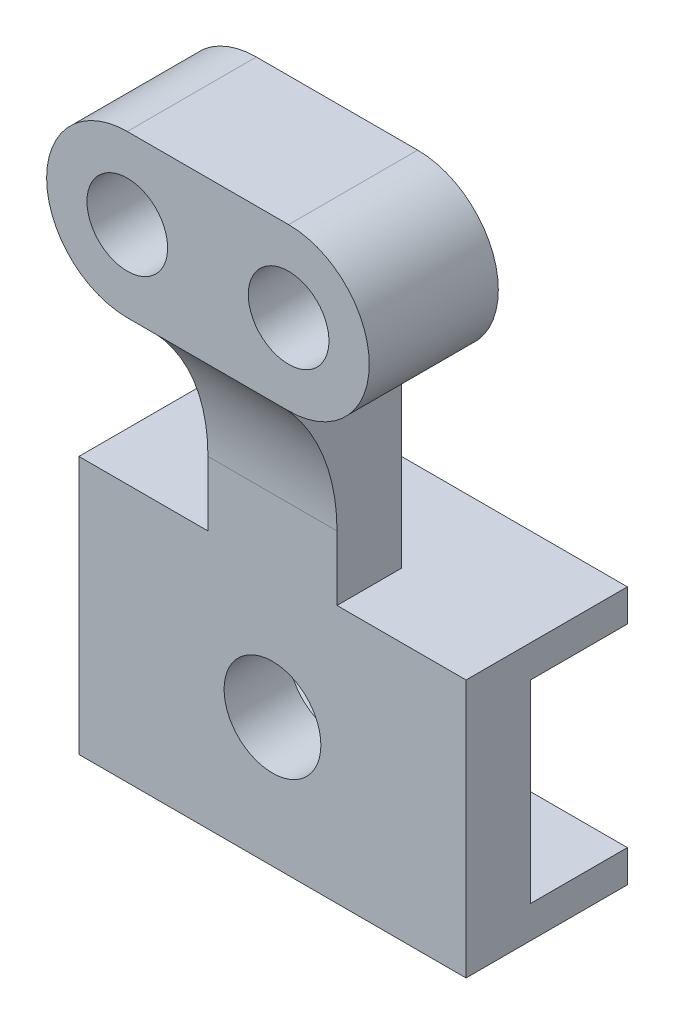
ISO-10303-21;
HEADER;
FILE_DESCRIPTION(('STEP AP214'),'2;1');
FILE_NAME('part.step','',(''),(''),'','','');
FILE_SCHEMA(('AUTOMOTIVE_DESIGN { 1 0 10303 214 1 1 1 1 }'));
ENDSEC;
DATA;
#1=APPLICATION_CONTEXT('core data for automotive mechanical design processes');
#2=APPLICATION_PROTOCOL_DEFINITION('international standard','automotive_design',2000,#1);
#3=PRODUCT_CONTEXT('',#1,'mechanical');
#4=PRODUCT('Part','Part','',(#3));
#5=PRODUCT_RELATED_PRODUCT_CATEGORY('part','',(#4));
#6=PRODUCT_DEFINITION_FORMATION('','',#4);
#7=PRODUCT_DEFINITION_CONTEXT('part definition',#1,'design');
#8=PRODUCT_DEFINITION('design','',#6,#7);
#9=PRODUCT_DEFINITION_SHAPE('','',#8);
#10=(LENGTH_UNIT() NAMED_UNIT(*) SI_UNIT(.MILLI.,.METRE.));
#11=(NAMED_UNIT(*) PLANE_ANGLE_UNIT() SI_UNIT($,.RADIAN.));
#12=(NAMED_UNIT(*) SI_UNIT($,.STERADIAN.) SOLID_ANGLE_UNIT());
#13=UNCERTAINTY_MEASURE_WITH_UNIT(LENGTH_MEASURE(1.E-05),#10,'distance_accuracy_value','');
#14=(GEOMETRIC_REPRESENTATION_CONTEXT(3) GLOBAL_UNCERTAINTY_ASSIGNED_CONTEXT((#13)) GLOBAL_UNIT_ASSIGNED_CONTEXT((#10,
#11,#12)) REPRESENTATION_CONTEXT('',''));
#15=CARTESIAN_POINT('',(0.,0.,0.));
#16=DIRECTION('',(0.,0.,1.));
#17=DIRECTION('',(1.,0.,0.));
#18=AXIS2_PLACEMENT_3D('',#15,#16,#17);
#19=CARTESIAN_POINT('',(38.1,-6.35,0.));
#20=DIRECTION('',(0.,0.,1.));
#21=DIRECTION('',(1.,0.,0.));
#22=AXIS2_PLACEMENT_3D('',#19,#20,#21);
#23=PLANE('',#22);
#24=DIRECTION('',(0.,1.,0.));
#25=VECTOR('',#24,1.);
#26=CARTESIAN_POINT('',(-38.1,-6.35,0.));
#27=LINE('',#26,#25);
#28=CARTESIAN_POINT('',(-38.1,-6.35,0.));
#29=VERTEX_POINT('',#28);
#30=CARTESIAN_POINT('',(-38.1,0.,0.));
#31=VERTEX_POINT('',#30);
#32=EDGE_CURVE('E244',#29,#31,#27,.T.);
#33=ORIENTED_EDGE('',*,*,#32,.T.);
#34=DIRECTION('',(-1.,0.,0.));
#35=VECTOR('',#34,1.);
#36=CARTESIAN_POINT('',(38.1,0.,0.));
#37=LINE('',#36,#35);
#38=CARTESIAN_POINT('',(38.1,0.,0.));
#39=VERTEX_POINT('',#38);
#40=EDGE_CURVE('E11',#39,#31,#37,.T.);
#41=ORIENTED_EDGE('',*,*,#40,.F.);
#42=DIRECTION('',(0.,1.,0.));
#43=VECTOR('',#42,1.);
#44=CARTESIAN_POINT('',(38.1,-6.35,0.));
#45=LINE('',#44,#43);
#46=CARTESIAN_POINT('',(38.1,-6.35,0.));
#47=VERTEX_POINT('',#46);
#48=EDGE_CURVE('E245',#47,#39,#45,.T.);
#49=ORIENTED_EDGE('',*,*,#48,.F.);
#50=DIRECTION('',(-1.,0.,0.));
#51=VECTOR('',#50,1.);
#52=CARTESIAN_POINT('',(38.1,-6.35,0.));
#53=LINE('',#52,#51);
#54=EDGE_CURVE('E263',#47,#29,#53,.T.);
#55=ORIENTED_EDGE('',*,*,#54,.T.);
#56=EDGE_LOOP('',(#33,#41,#49,#55));
#57=FACE_BOUND('',#56,.T.);
#58=ADVANCED_FACE('F41',(#57),#23,.F.);
#59=CARTESIAN_POINT('',(38.1,0.,0.));
#60=DIRECTION('',(0.,-1.,0.));
#61=DIRECTION('',(0.,0.,-1.));
#62=AXIS2_PLACEMENT_3D('',#59,#60,#61);
#63=PLANE('',#62);
#64=DIRECTION('',(-1.,0.,0.));
#65=VECTOR('',#64,1.);
#66=CARTESIAN_POINT('',(38.1,0.,31.75));
#67=LINE('',#66,#65);
#68=CARTESIAN_POINT('',(-12.7,0.,31.75));
#69=VERTEX_POINT('',#68);
#70=CARTESIAN_POINT('',(-38.1,0.,31.75));
#71=VERTEX_POINT('',#70);
#72=EDGE_CURVE('E61',#69,#71,#67,.T.);
#73=ORIENTED_EDGE('',*,*,#72,.F.);
#74=DIRECTION('',(0.,0.,-1.));
#75=VECTOR('',#74,1.);
#76=CARTESIAN_POINT('',(-12.7,0.,31.75));
#77=LINE('',#76,#75);
#78=CARTESIAN_POINT('',(-12.7,0.,19.05));
#79=VERTEX_POINT('',#78);
#80=EDGE_CURVE('E56',#69,#79,#77,.T.);
#81=ORIENTED_EDGE('',*,*,#80,.T.);
#82=DIRECTION('',(-1.,0.,0.));
#83=VECTOR('',#82,1.);
#84=CARTESIAN_POINT('',(12.7,0.,19.05));
#85=LINE('',#84,#83);
#86=CARTESIAN_POINT('',(12.7,0.,19.05));
#87=VERTEX_POINT('',#86);
#88=EDGE_CURVE('E238',#87,#79,#85,.T.);
#89=ORIENTED_EDGE('',*,*,#88,.F.);
#90=DIRECTION('',(0.,0.,-1.));
#91=VECTOR('',#90,1.);
#92=CARTESIAN_POINT('',(12.7,0.,31.75));
#93=LINE('',#92,#91);
#94=CARTESIAN_POINT('',(12.7,0.,31.75));
#95=VERTEX_POINT('',#94);
#96=EDGE_CURVE('E210',#95,#87,#93,.T.);
#97=ORIENTED_EDGE('',*,*,#96,.F.);
#98=CARTESIAN_POINT('',(38.1,0.,31.75));
#99=VERTEX_POINT('',#98);
#100=EDGE_CURVE('E49',#99,#95,#67,.T.);
#101=ORIENTED_EDGE('',*,*,#100,.F.);
#102=DIRECTION('',(0.,0.,1.));
#103=VECTOR('',#102,1.);
#104=CARTESIAN_POINT('',(38.1,0.,0.));
#105=LINE('',#104,#103);
#106=EDGE_CURVE('E248',#39,#99,#105,.T.);
#107=ORIENTED_EDGE('',*,*,#106,.F.);
#108=ORIENTED_EDGE('',*,*,#40,.T.);
#109=DIRECTION('',(0.,0.,1.));
#110=VECTOR('',#109,1.);
#111=CARTESIAN_POINT('',(-38.1,0.,0.));
#112=LINE('',#111,#110);
#113=EDGE_CURVE('E266',#31,#71,#112,.T.);
#114=ORIENTED_EDGE('',*,*,#113,.T.);
#115=EDGE_LOOP('',(#73,#81,#89,#97,#101,#107,#108,#114));
#116=FACE_BOUND('',#115,.T.);
#117=ADVANCED_FACE('F305',(#116),#63,.F.);
#118=CARTESIAN_POINT('',(38.1,0.,31.75));
#119=DIRECTION('',(0.,0.,-1.));
#120=DIRECTION('',(0.,1.,0.));
#121=AXIS2_PLACEMENT_3D('',#118,#119,#120);
#122=PLANE('',#121);
#123=CARTESIAN_POINT('',(0.,-25.4,31.75));
#124=DIRECTION('',(0.,0.,-1.));
#125=DIRECTION('',(0.,1.,0.));
#126=AXIS2_PLACEMENT_3D('',#123,#124,#125);
#127=CIRCLE('',#126,9.525);
#128=CARTESIAN_POINT('',(0.,-15.875,31.75));
#129=VERTEX_POINT('',#128);
#130=EDGE_CURVE('E241',#129,#129,#127,.T.);
#131=ORIENTED_EDGE('',*,*,#130,.T.);
#132=EDGE_LOOP('',(#131));
#133=FACE_BOUND('',#132,.T.);
#134=DIRECTION('',(0.,-1.,0.));
#135=VECTOR('',#134,1.);
#136=CARTESIAN_POINT('',(-38.1,0.,31.75));
#137=LINE('',#136,#135);
#138=CARTESIAN_POINT('',(-38.1,-50.8,31.75));
#139=VERTEX_POINT('',#138);
#140=EDGE_CURVE('E268',#71,#139,#137,.T.);
#141=ORIENTED_EDGE('',*,*,#140,.T.);
#142=DIRECTION('',(-1.,0.,0.));
#143=VECTOR('',#142,1.);
#144=CARTESIAN_POINT('',(38.1,-50.8,31.75));
#145=LINE('',#144,#143);
#146=CARTESIAN_POINT('',(38.1,-50.8,31.75));
#147=VERTEX_POINT('',#146);
#148=EDGE_CURVE('E293',#147,#139,#145,.T.);
#149=ORIENTED_EDGE('',*,*,#148,.F.);
#150=DIRECTION('',(0.,-1.,0.));
#151=VECTOR('',#150,1.);
#152=CARTESIAN_POINT('',(38.1,0.,31.75));
#153=LINE('',#152,#151);
#154=EDGE_CURVE('E251',#99,#147,#153,.T.);
#155=ORIENTED_EDGE('',*,*,#154,.F.);
#156=ORIENTED_EDGE('',*,*,#100,.T.);
#157=DIRECTION('',(0.,-1.,0.));
#158=VECTOR('',#157,1.);
#159=CARTESIAN_POINT('',(12.7,12.7,31.75));
#160=LINE('',#159,#158);
#161=CARTESIAN_POINT('',(12.7,12.7,31.75));
#162=VERTEX_POINT('',#161);
#163=EDGE_CURVE('E220',#162,#95,#160,.T.);
#164=ORIENTED_EDGE('',*,*,#163,.F.);
#165=DIRECTION('',(-1.,0.,0.));
#166=VECTOR('',#165,1.);
#167=CARTESIAN_POINT('',(12.7,12.7,31.75));
#168=LINE('',#167,#166);
#169=CARTESIAN_POINT('',(-12.7,12.7,31.75));
#170=VERTEX_POINT('',#169);
#171=EDGE_CURVE('E223',#162,#170,#168,.T.);
#172=ORIENTED_EDGE('',*,*,#171,.T.);
#173=DIRECTION('',(0.,-1.,0.));
#174=VECTOR('',#173,1.);
#175=CARTESIAN_POINT('',(-12.7,12.7,31.75));
#176=LINE('',#175,#174);
#177=EDGE_CURVE('E214',#170,#69,#176,.T.);
#178=ORIENTED_EDGE('',*,*,#177,.T.);
#179=ORIENTED_EDGE('',*,*,#72,.T.);
#180=EDGE_LOOP('',(#141,#149,#155,#156,#164,#172,#178,#179));
#181=FACE_BOUND('',#180,.T.);
#182=ADVANCED_FACE('F301',(#133,#181),#122,.F.);
#183=CARTESIAN_POINT('',(38.1,-50.8,31.75));
#184=DIRECTION('',(0.,1.,0.));
#185=DIRECTION('',(0.,0.,1.));
#186=AXIS2_PLACEMENT_3D('',#183,#184,#185);
#187=PLANE('',#186);
#188=DIRECTION('',(0.,0.,-1.));
#189=VECTOR('',#188,1.);
#190=CARTESIAN_POINT('',(-38.1,-50.8,31.75));
#191=LINE('',#190,#189);
#192=CARTESIAN_POINT('',(-38.1,-50.8,0.));
#193=VERTEX_POINT('',#192);
#194=EDGE_CURVE('E270',#139,#193,#191,.T.);
#195=ORIENTED_EDGE('',*,*,#194,.T.);
#196=DIRECTION('',(-1.,0.,0.));
#197=VECTOR('',#196,1.);
#198=CARTESIAN_POINT('',(38.1,-50.8,0.));
#199=LINE('',#198,#197);
#200=CARTESIAN_POINT('',(38.1,-50.8,0.));
#201=VERTEX_POINT('',#200);
#202=EDGE_CURVE('E290',#201,#193,#199,.T.);
#203=ORIENTED_EDGE('',*,*,#202,.F.);
#204=DIRECTION('',(0.,0.,-1.));
#205=VECTOR('',#204,1.);
#206=CARTESIAN_POINT('',(38.1,-50.8,31.75));
#207=LINE('',#206,#205);
#208=EDGE_CURVE('E253',#147,#201,#207,.T.);
#209=ORIENTED_EDGE('',*,*,#208,.F.);
#210=ORIENTED_EDGE('',*,*,#148,.T.);
#211=EDGE_LOOP('',(#195,#203,#209,#210));
#212=FACE_BOUND('',#211,.T.);
#213=ADVANCED_FACE('F315',(#212),#187,.F.);
#214=CARTESIAN_POINT('',(38.1,-50.8,0.));
#215=DIRECTION('',(0.,0.,1.));
#216=DIRECTION('',(0.,-1.,0.));
#217=AXIS2_PLACEMENT_3D('',#214,#215,#216);
#218=PLANE('',#217);
#219=DIRECTION('',(0.,1.,0.));
#220=VECTOR('',#219,1.);
#221=CARTESIAN_POINT('',(-38.1,-50.8,0.));
#222=LINE('',#221,#220);
#223=CARTESIAN_POINT('',(-38.1,-44.45,0.));
#224=VERTEX_POINT('',#223);
#225=EDGE_CURVE('E272',#193,#224,#222,.T.);
#226=ORIENTED_EDGE('',*,*,#225,.T.);
#227=DIRECTION('',(-1.,0.,0.));
#228=VECTOR('',#227,1.);
#229=CARTESIAN_POINT('',(38.1,-44.45,0.));
#230=LINE('',#229,#228);
#231=CARTESIAN_POINT('',(38.1,-44.45,0.));
#232=VERTEX_POINT('',#231);
#233=EDGE_CURVE('E287',#232,#224,#230,.T.);
#234=ORIENTED_EDGE('',*,*,#233,.F.);
#235=DIRECTION('',(0.,1.,0.));
#236=VECTOR('',#235,1.);
#237=CARTESIAN_POINT('',(38.1,-50.8,0.));
#238=LINE('',#237,#236);
#239=EDGE_CURVE('E255',#201,#232,#238,.T.);
#240=ORIENTED_EDGE('',*,*,#239,.F.);
#241=ORIENTED_EDGE('',*,*,#202,.T.);
#242=EDGE_LOOP('',(#226,#234,#240,#241));
#243=FACE_BOUND('',#242,.T.);
#244=ADVANCED_FACE('F319',(#243),#218,.F.);
#245=CARTESIAN_POINT('',(38.1,-44.45,0.));
#246=DIRECTION('',(0.,-1.,0.));
#247=DIRECTION('',(0.,0.,-1.));
#248=AXIS2_PLACEMENT_3D('',#245,#246,#247);
#249=PLANE('',#248);
#250=DIRECTION('',(0.,0.,1.));
#251=VECTOR('',#250,1.);
#252=CARTESIAN_POINT('',(-38.1,-44.45,0.));
#253=LINE('',#252,#251);
#254=CARTESIAN_POINT('',(-38.1,-44.45,19.05));
#255=VERTEX_POINT('',#254);
#256=EDGE_CURVE('E274',#224,#255,#253,.T.);
#257=ORIENTED_EDGE('',*,*,#256,.T.);
#258=DIRECTION('',(-1.,0.,0.));
#259=VECTOR('',#258,1.);
#260=CARTESIAN_POINT('',(38.1,-44.45,19.05));
#261=LINE('',#260,#259);
#262=CARTESIAN_POINT('',(38.1,-44.45,19.05));
#263=VERTEX_POINT('',#262);
#264=EDGE_CURVE('E284',#263,#255,#261,.T.);
#265=ORIENTED_EDGE('',*,*,#264,.F.);
#266=DIRECTION('',(0.,0.,1.));
#267=VECTOR('',#266,1.);
#268=CARTESIAN_POINT('',(38.1,-44.45,0.));
#269=LINE('',#268,#267);
#270=EDGE_CURVE('E257',#232,#263,#269,.T.);
#271=ORIENTED_EDGE('',*,*,#270,.F.);
#272=ORIENTED_EDGE('',*,*,#233,.T.);
#273=EDGE_LOOP('',(#257,#265,#271,#272));
#274=FACE_BOUND('',#273,.T.);
#275=ADVANCED_FACE('F377',(#274),#249,.F.);
#276=CARTESIAN_POINT('',(38.1,-44.45,19.05));
#277=DIRECTION('',(0.,0.,1.));
#278=DIRECTION('',(0.,-1.,0.));
#279=AXIS2_PLACEMENT_3D('',#276,#277,#278);
#280=PLANE('',#279);
#281=CARTESIAN_POINT('',(0.,-25.4,19.05));
#282=DIRECTION('',(0.,0.,1.));
#283=DIRECTION('',(0.,-1.,0.));
#284=AXIS2_PLACEMENT_3D('',#281,#282,#283);
#285=CIRCLE('',#284,9.525);
#286=CARTESIAN_POINT('',(0.,-34.925,19.05));
#287=VERTEX_POINT('',#286);
#288=EDGE_CURVE('E44',#287,#287,#285,.T.);
#289=ORIENTED_EDGE('',*,*,#288,.T.);
#290=EDGE_LOOP('',(#289));
#291=FACE_BOUND('',#290,.T.);
#292=DIRECTION('',(0.,1.,0.));
#293=VECTOR('',#292,1.);
#294=CARTESIAN_POINT('',(-38.1,-44.45,19.05));
#295=LINE('',#294,#293);
#296=CARTESIAN_POINT('',(-38.1,-6.35,19.05));
#297=VERTEX_POINT('',#296);
#298=EDGE_CURVE('E276',#255,#297,#295,.T.);
#299=ORIENTED_EDGE('',*,*,#298,.T.);
#300=DIRECTION('',(-1.,0.,0.));
#301=VECTOR('',#300,1.);
#302=CARTESIAN_POINT('',(38.1,-6.35,19.05));
#303=LINE('',#302,#301);
#304=CARTESIAN_POINT('',(38.1,-6.35,19.05));
#305=VERTEX_POINT('',#304);
#306=EDGE_CURVE('E281',#305,#297,#303,.T.);
#307=ORIENTED_EDGE('',*,*,#306,.F.);
#308=DIRECTION('',(0.,1.,0.));
#309=VECTOR('',#308,1.);
#310=CARTESIAN_POINT('',(38.1,-44.45,19.05));
#311=LINE('',#310,#309);
#312=EDGE_CURVE('E259',#263,#305,#311,.T.);
#313=ORIENTED_EDGE('',*,*,#312,.F.);
#314=ORIENTED_EDGE('',*,*,#264,.T.);
#315=EDGE_LOOP('',(#299,#307,#313,#314));
#316=FACE_BOUND('',#315,.T.);
#317=ADVANCED_FACE('F375',(#291,#316),#280,.F.);
#318=CARTESIAN_POINT('',(38.1,-6.35,19.05));
#319=DIRECTION('',(0.,1.,0.));
#320=DIRECTION('',(0.,0.,1.));
#321=AXIS2_PLACEMENT_3D('',#318,#319,#320);
#322=PLANE('',#321);
#323=DIRECTION('',(0.,0.,-1.));
#324=VECTOR('',#323,1.);
#325=CARTESIAN_POINT('',(-38.1,-6.35,19.05));
#326=LINE('',#325,#324);
#327=EDGE_CURVE('E249',#297,#29,#326,.T.);
#328=ORIENTED_EDGE('',*,*,#327,.T.);
#329=ORIENTED_EDGE('',*,*,#54,.F.);
#330=DIRECTION('',(0.,0.,-1.));
#331=VECTOR('',#330,1.);
#332=CARTESIAN_POINT('',(38.1,-6.35,19.05));
#333=LINE('',#332,#331);
#334=EDGE_CURVE('E261',#305,#47,#333,.T.);
#335=ORIENTED_EDGE('',*,*,#334,.F.);
#336=ORIENTED_EDGE('',*,*,#306,.T.);
#337=EDGE_LOOP('',(#328,#329,#335,#336));
#338=FACE_BOUND('',#337,.T.);
#339=ADVANCED_FACE('F370',(#338),#322,.F.);
#340=CARTESIAN_POINT('',(38.1,0.,0.));
#341=DIRECTION('',(1.,0.,0.));
#342=DIRECTION('',(0.,0.,-1.));
#343=AXIS2_PLACEMENT_3D('',#340,#341,#342);
#344=PLANE('',#343);
#345=ORIENTED_EDGE('',*,*,#48,.T.);
#346=ORIENTED_EDGE('',*,*,#106,.T.);
#347=ORIENTED_EDGE('',*,*,#154,.T.);
#348=ORIENTED_EDGE('',*,*,#208,.T.);
#349=ORIENTED_EDGE('',*,*,#239,.T.);
#350=ORIENTED_EDGE('',*,*,#270,.T.);
#351=ORIENTED_EDGE('',*,*,#312,.T.);
#352=ORIENTED_EDGE('',*,*,#334,.T.);
#353=EDGE_LOOP('',(#345,#346,#347,#348,#349,#350,#351,#352));
#354=FACE_BOUND('',#353,.T.);
#355=ADVANCED_FACE('F323',(#354),#344,.T.);
#356=CARTESIAN_POINT('',(-38.1,0.,0.));
#357=DIRECTION('',(1.,0.,0.));
#358=DIRECTION('',(0.,0.,-1.));
#359=AXIS2_PLACEMENT_3D('',#356,#357,#358);
#360=PLANE('',#359);
#361=ORIENTED_EDGE('',*,*,#32,.F.);
#362=ORIENTED_EDGE('',*,*,#327,.F.);
#363=ORIENTED_EDGE('',*,*,#298,.F.);
#364=ORIENTED_EDGE('',*,*,#256,.F.);
#365=ORIENTED_EDGE('',*,*,#225,.F.);
#366=ORIENTED_EDGE('',*,*,#194,.F.);
#367=ORIENTED_EDGE('',*,*,#140,.F.);
#368=ORIENTED_EDGE('',*,*,#113,.F.);
#369=EDGE_LOOP('',(#361,#362,#363,#364,#365,#366,#367,#368));
#370=FACE_BOUND('',#369,.T.);
#371=ADVANCED_FACE('F310',(#370),#360,.F.);
#372=CARTESIAN_POINT('',(0.,-25.4,0.));
#373=DIRECTION('',(0.,0.,1.));
#374=DIRECTION('',(1.,0.,0.));
#375=AXIS2_PLACEMENT_3D('',#372,#373,#374);
#376=CYLINDRICAL_SURFACE('',#375,9.525);
#377=ORIENTED_EDGE('',*,*,#288,.F.);
#378=EDGE_LOOP('',(#377));
#379=FACE_BOUND('',#378,.T.);
#380=ORIENTED_EDGE('',*,*,#130,.F.);
#381=EDGE_LOOP('',(#380));
#382=FACE_BOUND('',#381,.T.);
#383=ADVANCED_FACE('F398',(#379,#382),#376,.F.);
#384=CARTESIAN_POINT('',(12.7,0.,19.05));
#385=DIRECTION('',(0.,0.,1.));
#386=DIRECTION('',(1.,0.,0.));
#387=AXIS2_PLACEMENT_3D('',#384,#385,#386);
#388=PLANE('',#387);
#389=DIRECTION('',(0.,1.,0.));
#390=VECTOR('',#389,1.);
#391=CARTESIAN_POINT('',(-12.7,0.,19.05));
#392=LINE('',#391,#390);
#393=CARTESIAN_POINT('',(-12.7,41.0980633142473,19.05));
#394=VERTEX_POINT('',#393);
#395=EDGE_CURVE('E225',#79,#394,#392,.T.);
#396=ORIENTED_EDGE('',*,*,#395,.T.);
#397=DIRECTION('',(-1.,0.,0.));
#398=VECTOR('',#397,1.);
#399=CARTESIAN_POINT('',(-15.875,41.0980633142473,19.05));
#400=LINE('',#399,#398);
#401=CARTESIAN_POINT('',(-15.875,41.0980633142473,19.05));
#402=VERTEX_POINT('',#401);
#403=EDGE_CURVE('E189',#394,#402,#400,.T.);
#404=ORIENTED_EDGE('',*,*,#403,.T.);
#405=CARTESIAN_POINT('',(-15.875,56.9730633142473,19.05));
#406=DIRECTION('',(0.,0.,-1.));
#407=DIRECTION('',(-1.,0.,0.));
#408=AXIS2_PLACEMENT_3D('',#405,#406,#407);
#409=CIRCLE('',#408,15.875);
#410=CARTESIAN_POINT('',(-15.875,72.8480633142473,19.05));
#411=VERTEX_POINT('',#410);
#412=EDGE_CURVE('E199',#402,#411,#409,.T.);
#413=ORIENTED_EDGE('',*,*,#412,.T.);
#414=DIRECTION('',(1.,0.,0.));
#415=VECTOR('',#414,1.);
#416=CARTESIAN_POINT('',(-15.875,72.8480633142473,19.05));
#417=LINE('',#416,#415);
#418=CARTESIAN_POINT('',(15.875,72.8480633142473,19.05));
#419=VERTEX_POINT('',#418);
#420=EDGE_CURVE('E164',#411,#419,#417,.T.);
#421=ORIENTED_EDGE('',*,*,#420,.T.);
#422=CARTESIAN_POINT('',(15.875,56.9730633142473,19.05));
#423=DIRECTION('',(0.,0.,-1.));
#424=DIRECTION('',(-1.,0.,0.));
#425=AXIS2_PLACEMENT_3D('',#422,#423,#424);
#426=CIRCLE('',#425,15.875);
#427=CARTESIAN_POINT('',(15.875,41.0980633142473,19.05));
#428=VERTEX_POINT('',#427);
#429=EDGE_CURVE('E203',#419,#428,#426,.T.);
#430=ORIENTED_EDGE('',*,*,#429,.T.);
#431=CARTESIAN_POINT('',(12.7,41.0980633142473,19.05));
#432=VERTEX_POINT('',#431);
#433=EDGE_CURVE('E186',#428,#432,#400,.T.);
#434=ORIENTED_EDGE('',*,*,#433,.T.);
#435=DIRECTION('',(0.,1.,0.));
#436=VECTOR('',#435,1.);
#437=CARTESIAN_POINT('',(12.7,0.,19.05));
#438=LINE('',#437,#436);
#439=EDGE_CURVE('E213',#87,#432,#438,.T.);
#440=ORIENTED_EDGE('',*,*,#439,.F.);
#441=ORIENTED_EDGE('',*,*,#88,.T.);
#442=EDGE_LOOP('',(#396,#404,#413,#421,#430,#434,#440,#441));
#443=FACE_BOUND('',#442,.T.);
#444=CARTESIAN_POINT('',(-15.875,56.9730633142473,19.05));
#445=DIRECTION('',(0.,0.,-1.));
#446=DIRECTION('',(-1.,0.,0.));
#447=AXIS2_PLACEMENT_3D('',#444,#445,#446);
#448=CIRCLE('',#447,7.9375);
#449=CARTESIAN_POINT('',(-23.8125,56.9730633142473,19.05));
#450=VERTEX_POINT('',#449);
#451=EDGE_CURVE('E562',#450,#450,#448,.T.);
#452=ORIENTED_EDGE('',*,*,#451,.F.);
#453=EDGE_LOOP('',(#452));
#454=FACE_BOUND('',#453,.T.);
#455=CARTESIAN_POINT('',(15.875,56.9730633142473,19.05));
#456=DIRECTION('',(0.,0.,-1.));
#457=DIRECTION('',(-1.,0.,0.));
#458=AXIS2_PLACEMENT_3D('',#455,#456,#457);
#459=CIRCLE('',#458,7.9375);
#460=CARTESIAN_POINT('',(7.93750000000001,56.9730633142473,19.05));
#461=VERTEX_POINT('',#460);
#462=EDGE_CURVE('E192',#461,#461,#459,.T.);
#463=ORIENTED_EDGE('',*,*,#462,.F.);
#464=EDGE_LOOP('',(#463));
#465=FACE_BOUND('',#464,.T.);
#466=ADVANCED_FACE('F338',(#443,#454,#465),#388,.F.);
#467=CARTESIAN_POINT('',(12.7,12.7,69.85));
#468=DIRECTION('',(-1.,0.,0.));
#469=DIRECTION('',(0.,0.,1.));
#470=AXIS2_PLACEMENT_3D('',#467,#468,#469);
#471=CYLINDRICAL_SURFACE('',#470,38.1);
#472=CARTESIAN_POINT('',(-12.7,12.7,69.85));
#473=DIRECTION('',(-1.,0.,0.));
#474=DIRECTION('',(0.,0.,1.));
#475=AXIS2_PLACEMENT_3D('',#472,#473,#474);
#476=CIRCLE('',#475,38.1);
#477=CARTESIAN_POINT('',(-12.7,41.0980633142473,44.45));
#478=VERTEX_POINT('',#477);
#479=EDGE_CURVE('E230',#478,#170,#476,.T.);
#480=ORIENTED_EDGE('',*,*,#479,.T.);
#481=ORIENTED_EDGE('',*,*,#171,.F.);
#482=CARTESIAN_POINT('',(12.7,12.7,69.85));
#483=DIRECTION('',(-1.,0.,0.));
#484=DIRECTION('',(0.,0.,1.));
#485=AXIS2_PLACEMENT_3D('',#482,#483,#484);
#486=CIRCLE('',#485,38.1);
#487=CARTESIAN_POINT('',(12.7,41.0980633142473,44.45));
#488=VERTEX_POINT('',#487);
#489=EDGE_CURVE('E218',#488,#162,#486,.T.);
#490=ORIENTED_EDGE('',*,*,#489,.F.);
#491=DIRECTION('',(-1.,0.,0.));
#492=VECTOR('',#491,1.);
#493=CARTESIAN_POINT('',(12.7,41.0980633142473,44.45));
#494=LINE('',#493,#492);
#495=EDGE_CURVE('E235',#488,#478,#494,.T.);
#496=ORIENTED_EDGE('',*,*,#495,.T.);
#497=EDGE_LOOP('',(#480,#481,#490,#496));
#498=FACE_BOUND('',#497,.T.);
#499=ADVANCED_FACE('F345',(#498),#471,.F.);
#500=CARTESIAN_POINT('',(12.7,12.7,69.85));
#501=DIRECTION('',(-1.,0.,0.));
#502=DIRECTION('',(0.,0.,1.));
#503=AXIS2_PLACEMENT_3D('',#500,#501,#502);
#504=PLANE('',#503);
#505=ORIENTED_EDGE('',*,*,#96,.T.);
#506=ORIENTED_EDGE('',*,*,#439,.T.);
#507=DIRECTION('',(0.,0.,1.));
#508=VECTOR('',#507,1.);
#509=CARTESIAN_POINT('',(12.7,41.0980633142473,44.45));
#510=LINE('',#509,#508);
#511=EDGE_CURVE('E216',#432,#488,#510,.T.);
#512=ORIENTED_EDGE('',*,*,#511,.T.);
#513=ORIENTED_EDGE('',*,*,#489,.T.);
#514=ORIENTED_EDGE('',*,*,#163,.T.);
#515=EDGE_LOOP('',(#505,#506,#512,#513,#514));
#516=FACE_BOUND('',#515,.T.);
#517=ADVANCED_FACE('F328',(#516),#504,.F.);
#518=CARTESIAN_POINT('',(-12.7,12.7,69.85));
#519=DIRECTION('',(-1.,0.,0.));
#520=DIRECTION('',(0.,0.,1.));
#521=AXIS2_PLACEMENT_3D('',#518,#519,#520);
#522=PLANE('',#521);
#523=ORIENTED_EDGE('',*,*,#80,.F.);
#524=ORIENTED_EDGE('',*,*,#177,.F.);
#525=ORIENTED_EDGE('',*,*,#479,.F.);
#526=DIRECTION('',(0.,0.,1.));
#527=VECTOR('',#526,1.);
#528=CARTESIAN_POINT('',(-12.7,41.0980633142473,44.45));
#529=LINE('',#528,#527);
#530=EDGE_CURVE('E227',#394,#478,#529,.T.);
#531=ORIENTED_EDGE('',*,*,#530,.F.);
#532=ORIENTED_EDGE('',*,*,#395,.F.);
#533=EDGE_LOOP('',(#523,#524,#525,#531,#532));
#534=FACE_BOUND('',#533,.T.);
#535=ADVANCED_FACE('F334',(#534),#522,.T.);
#536=CARTESIAN_POINT('',(-15.875,41.0980633142473,44.45));
#537=DIRECTION('',(0.,-1.,0.));
#538=DIRECTION('',(1.,0.,0.));
#539=AXIS2_PLACEMENT_3D('',#536,#537,#538);
#540=PLANE('',#539);
#541=ORIENTED_EDGE('',*,*,#511,.F.);
#542=ORIENTED_EDGE('',*,*,#433,.F.);
#543=DIRECTION('',(0.,0.,-1.));
#544=VECTOR('',#543,1.);
#545=CARTESIAN_POINT('',(15.875,41.0980633142473,44.45));
#546=LINE('',#545,#544);
#547=CARTESIAN_POINT('',(15.875,41.0980633142473,44.45));
#548=VERTEX_POINT('',#547);
#549=EDGE_CURVE('E207',#548,#428,#546,.T.);
#550=ORIENTED_EDGE('',*,*,#549,.F.);
#551=DIRECTION('',(-1.,0.,0.));
#552=VECTOR('',#551,1.);
#553=CARTESIAN_POINT('',(-15.875,41.0980633142473,44.45));
#554=LINE('',#553,#552);
#555=EDGE_CURVE('E170',#548,#488,#554,.T.);
#556=ORIENTED_EDGE('',*,*,#555,.T.);
#557=EDGE_LOOP('',(#541,#542,#550,#556));
#558=FACE_BOUND('',#557,.T.);
#559=ADVANCED_FACE('F343',(#558),#540,.T.);
#560=CARTESIAN_POINT('',(-15.875,56.9730633142473,44.45));
#561=DIRECTION('',(0.,0.,-1.));
#562=DIRECTION('',(-1.,0.,0.));
#563=AXIS2_PLACEMENT_3D('',#560,#561,#562);
#564=CYLINDRICAL_SURFACE('',#563,15.875);
#565=ORIENTED_EDGE('',*,*,#412,.F.);
#566=DIRECTION('',(0.,0.,-1.));
#567=VECTOR('',#566,1.);
#568=CARTESIAN_POINT('',(-15.875,41.0980633142473,44.45));
#569=LINE('',#568,#567);
#570=CARTESIAN_POINT('',(-15.875,41.0980633142473,44.45));
#571=VERTEX_POINT('',#570);
#572=EDGE_CURVE('E185',#571,#402,#569,.T.);
#573=ORIENTED_EDGE('',*,*,#572,.F.);
#574=CARTESIAN_POINT('',(-15.875,56.9730633142473,44.45));
#575=DIRECTION('',(0.,0.,-1.));
#576=DIRECTION('',(-1.,0.,0.));
#577=AXIS2_PLACEMENT_3D('',#574,#575,#576);
#578=CIRCLE('',#577,15.875);
#579=CARTESIAN_POINT('',(-15.875,72.8480633142473,44.45));
#580=VERTEX_POINT('',#579);
#581=EDGE_CURVE('E177',#571,#580,#578,.T.);
#582=ORIENTED_EDGE('',*,*,#581,.T.);
#583=DIRECTION('',(0.,0.,-1.));
#584=VECTOR('',#583,1.);
#585=CARTESIAN_POINT('',(-15.875,72.8480633142473,44.45));
#586=LINE('',#585,#584);
#587=EDGE_CURVE('E159',#580,#411,#586,.T.);
#588=ORIENTED_EDGE('',*,*,#587,.T.);
#589=EDGE_LOOP('',(#565,#573,#582,#588));
#590=FACE_BOUND('',#589,.T.);
#591=ADVANCED_FACE('F183',(#590),#564,.T.);
#592=ORIENTED_EDGE('',*,*,#403,.F.);
#593=ORIENTED_EDGE('',*,*,#530,.T.);
#594=EDGE_CURVE('E196',#478,#571,#554,.T.);
#595=ORIENTED_EDGE('',*,*,#594,.T.);
#596=ORIENTED_EDGE('',*,*,#572,.T.);
#597=EDGE_LOOP('',(#592,#593,#595,#596));
#598=FACE_BOUND('',#597,.T.);
#599=ADVANCED_FACE('F347',(#598),#540,.T.);
#600=CARTESIAN_POINT('',(15.875,56.9730633142473,44.45));
#601=DIRECTION('',(0.,0.,-1.));
#602=DIRECTION('',(-1.,0.,0.));
#603=AXIS2_PLACEMENT_3D('',#600,#601,#602);
#604=CYLINDRICAL_SURFACE('',#603,15.875);
#605=ORIENTED_EDGE('',*,*,#429,.F.);
#606=DIRECTION('',(0.,0.,-1.));
#607=VECTOR('',#606,1.);
#608=CARTESIAN_POINT('',(15.875,72.8480633142473,44.45));
#609=LINE('',#608,#607);
#610=CARTESIAN_POINT('',(15.875,72.8480633142473,44.45));
#611=VERTEX_POINT('',#610);
#612=EDGE_CURVE('E169',#611,#419,#609,.T.);
#613=ORIENTED_EDGE('',*,*,#612,.F.);
#614=CARTESIAN_POINT('',(15.875,56.9730633142473,44.45));
#615=DIRECTION('',(0.,0.,-1.));
#616=DIRECTION('',(-1.,0.,0.));
#617=AXIS2_PLACEMENT_3D('',#614,#615,#616);
#618=CIRCLE('',#617,15.875);
#619=EDGE_CURVE('E180',#611,#548,#618,.T.);
#620=ORIENTED_EDGE('',*,*,#619,.T.);
#621=ORIENTED_EDGE('',*,*,#549,.T.);
#622=EDGE_LOOP('',(#605,#613,#620,#621));
#623=FACE_BOUND('',#622,.T.);
#624=ADVANCED_FACE('F349',(#623),#604,.T.);
#625=CARTESIAN_POINT('',(-15.875,72.8480633142473,44.45));
#626=DIRECTION('',(0.,1.,0.));
#627=DIRECTION('',(0.,0.,1.));
#628=AXIS2_PLACEMENT_3D('',#625,#626,#627);
#629=PLANE('',#628);
#630=ORIENTED_EDGE('',*,*,#420,.F.);
#631=ORIENTED_EDGE('',*,*,#587,.F.);
#632=DIRECTION('',(1.,0.,0.));
#633=VECTOR('',#632,1.);
#634=CARTESIAN_POINT('',(-15.875,72.8480633142473,44.45));
#635=LINE('',#634,#633);
#636=EDGE_CURVE('E162',#580,#611,#635,.T.);
#637=ORIENTED_EDGE('',*,*,#636,.T.);
#638=ORIENTED_EDGE('',*,*,#612,.T.);
#639=EDGE_LOOP('',(#630,#631,#637,#638));
#640=FACE_BOUND('',#639,.T.);
#641=ADVANCED_FACE('F161',(#640),#629,.T.);
#642=CARTESIAN_POINT('',(-15.875,56.9730633142473,44.45));
#643=DIRECTION('',(0.,0.,-1.));
#644=DIRECTION('',(-1.,0.,0.));
#645=AXIS2_PLACEMENT_3D('',#642,#643,#644);
#646=PLANE('',#645);
#647=CARTESIAN_POINT('',(-15.875,56.9730633142473,44.45));
#648=DIRECTION('',(0.,0.,-1.));
#649=DIRECTION('',(-1.,0.,0.));
#650=AXIS2_PLACEMENT_3D('',#647,#648,#649);
#651=CIRCLE('',#650,7.9375);
#652=CARTESIAN_POINT('',(-23.8125,56.9730633142473,44.45));
#653=VERTEX_POINT('',#652);
#654=EDGE_CURVE('E559',#653,#653,#651,.T.);
#655=ORIENTED_EDGE('',*,*,#654,.T.);
#656=EDGE_LOOP('',(#655));
#657=FACE_BOUND('',#656,.T.);
#658=CARTESIAN_POINT('',(15.875,56.9730633142473,44.45));
#659=DIRECTION('',(0.,0.,-1.));
#660=DIRECTION('',(-1.,0.,0.));
#661=AXIS2_PLACEMENT_3D('',#658,#659,#660);
#662=CIRCLE('',#661,7.9375);
#663=CARTESIAN_POINT('',(7.93750000000001,56.9730633142473,44.45));
#664=VERTEX_POINT('',#663);
#665=EDGE_CURVE('E201',#664,#664,#662,.T.);
#666=ORIENTED_EDGE('',*,*,#665,.T.);
#667=EDGE_LOOP('',(#666));
#668=FACE_BOUND('',#667,.T.);
#669=ORIENTED_EDGE('',*,*,#581,.F.);
#670=ORIENTED_EDGE('',*,*,#594,.F.);
#671=ORIENTED_EDGE('',*,*,#495,.F.);
#672=ORIENTED_EDGE('',*,*,#555,.F.);
#673=ORIENTED_EDGE('',*,*,#619,.F.);
#674=ORIENTED_EDGE('',*,*,#636,.F.);
#675=EDGE_LOOP('',(#669,#670,#671,#672,#673,#674));
#676=FACE_BOUND('',#675,.T.);
#677=ADVANCED_FACE('F175',(#657,#668,#676),#646,.F.);
#678=CARTESIAN_POINT('',(15.875,56.9730633142473,44.45));
#679=DIRECTION('',(0.,0.,-1.));
#680=DIRECTION('',(-1.,0.,0.));
#681=AXIS2_PLACEMENT_3D('',#678,#679,#680);
#682=CYLINDRICAL_SURFACE('',#681,7.9375);
#683=ORIENTED_EDGE('',*,*,#665,.F.);
#684=EDGE_LOOP('',(#683));
#685=FACE_BOUND('',#684,.T.);
#686=ORIENTED_EDGE('',*,*,#462,.T.);
#687=EDGE_LOOP('',(#686));
#688=FACE_BOUND('',#687,.T.);
#689=ADVANCED_FACE('F534',(#685,#688),#682,.F.);
#690=CARTESIAN_POINT('',(-15.875,56.9730633142473,44.45));
#691=DIRECTION('',(0.,0.,-1.));
#692=DIRECTION('',(-1.,0.,0.));
#693=AXIS2_PLACEMENT_3D('',#690,#691,#692);
#694=CYLINDRICAL_SURFACE('',#693,7.9375);
#695=ORIENTED_EDGE('',*,*,#654,.F.);
#696=EDGE_LOOP('',(#695));
#697=FACE_BOUND('',#696,.T.);
#698=ORIENTED_EDGE('',*,*,#451,.T.);
#699=EDGE_LOOP('',(#698));
#700=FACE_BOUND('',#699,.T.);
#701=ADVANCED_FACE('F543',(#697,#700),#694,.F.);
#702=CLOSED_SHELL('',(#58,#117,#182,#213,#244,#275,#317,#339,#355,#371,#383,#466,#499,#517,#535,
#559,#591,#599,#624,#641,#677,#689,#701));
#703=MANIFOLD_SOLID_BREP('B2',#702);
#704=ADVANCED_BREP_SHAPE_REPRESENTATION('',(#18,#703),#14);
#705=SHAPE_DEFINITION_REPRESENTATION(#9,#704);
ENDSEC;
END-ISO-10303-21;
